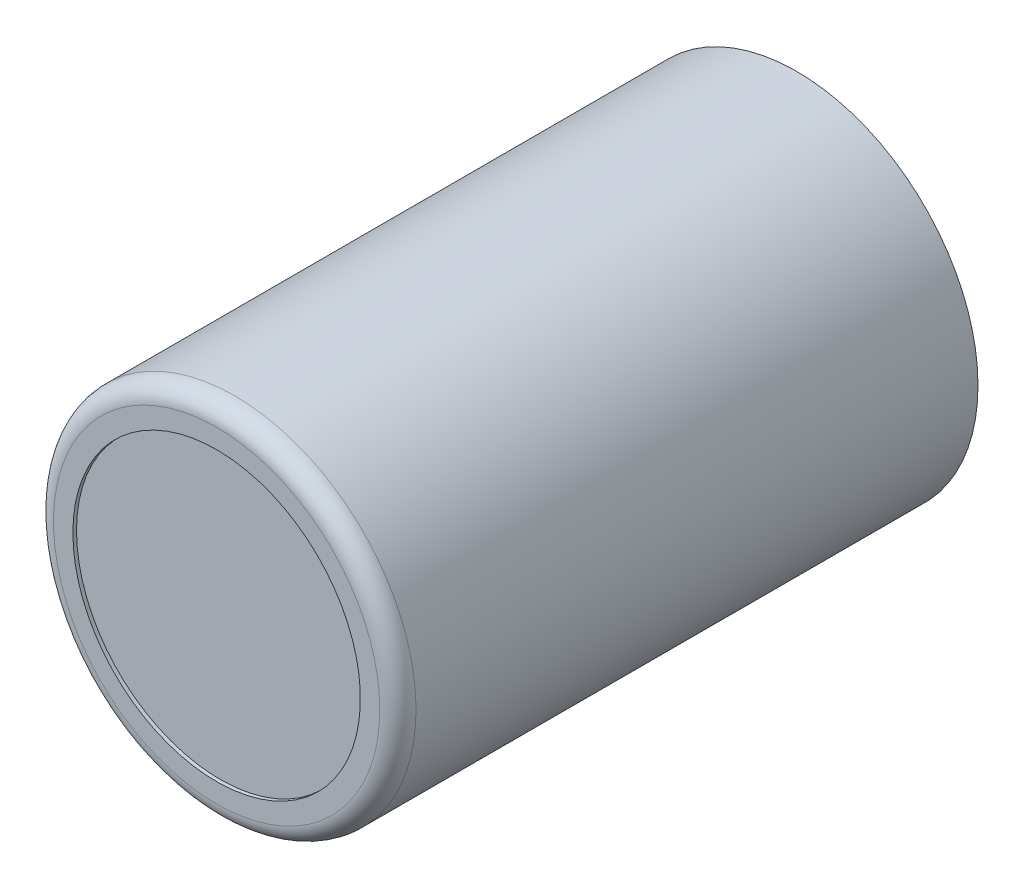
ISO-10303-21;
HEADER;
FILE_DESCRIPTION(('STEP AP214'),'2;1');
FILE_NAME('part.step','',(''),(''),'','','');
FILE_SCHEMA(('AUTOMOTIVE_DESIGN { 1 0 10303 214 1 1 1 1 }'));
ENDSEC;
DATA;
#1=APPLICATION_CONTEXT('core data for automotive mechanical design processes');
#2=APPLICATION_PROTOCOL_DEFINITION('international standard','automotive_design',2000,#1);
#3=PRODUCT_CONTEXT('',#1,'mechanical');
#4=PRODUCT('Part','Part','',(#3));
#5=PRODUCT_RELATED_PRODUCT_CATEGORY('part','',(#4));
#6=PRODUCT_DEFINITION_FORMATION('','',#4);
#7=PRODUCT_DEFINITION_CONTEXT('part definition',#1,'design');
#8=PRODUCT_DEFINITION('design','',#6,#7);
#9=PRODUCT_DEFINITION_SHAPE('','',#8);
#10=(LENGTH_UNIT() NAMED_UNIT(*) SI_UNIT(.MILLI.,.METRE.));
#11=(NAMED_UNIT(*) PLANE_ANGLE_UNIT() SI_UNIT($,.RADIAN.));
#12=(NAMED_UNIT(*) SI_UNIT($,.STERADIAN.) SOLID_ANGLE_UNIT());
#13=UNCERTAINTY_MEASURE_WITH_UNIT(LENGTH_MEASURE(1.E-05),#10,'distance_accuracy_value','');
#14=(GEOMETRIC_REPRESENTATION_CONTEXT(3) GLOBAL_UNCERTAINTY_ASSIGNED_CONTEXT((#13)) GLOBAL_UNIT_ASSIGNED_CONTEXT((#10,
#11,#12)) REPRESENTATION_CONTEXT('',''));
#15=CARTESIAN_POINT('',(0.,0.,0.));
#16=DIRECTION('',(0.,0.,1.));
#17=DIRECTION('',(1.,0.,0.));
#18=AXIS2_PLACEMENT_3D('',#15,#16,#17);
#19=CARTESIAN_POINT('',(6.985,-6.985,-10.16));
#20=DIRECTION('',(0.,0.,-1.));
#21=DIRECTION('',(-1.,0.,0.));
#22=AXIS2_PLACEMENT_3D('',#19,#20,#21);
#23=PLANE('',#22);
#24=CARTESIAN_POINT('',(0.,0.,-10.16));
#25=DIRECTION('',(0.,0.,1.));
#26=DIRECTION('',(1.,0.,0.));
#27=AXIS2_PLACEMENT_3D('',#24,#25,#26);
#28=CIRCLE('',#27,6.35);
#29=CARTESIAN_POINT('',(6.35,0.,-10.16));
#30=VERTEX_POINT('',#29);
#31=EDGE_CURVE('E21',#30,#30,#28,.T.);
#32=ORIENTED_EDGE('',*,*,#31,.F.);
#33=EDGE_LOOP('',(#32));
#34=FACE_BOUND('',#33,.T.);
#35=ADVANCED_FACE('F17',(#34),#23,.T.);
#36=CARTESIAN_POINT('',(0.,0.,9.525));
#37=DIRECTION('',(0.,0.,1.));
#38=DIRECTION('',(1.,0.,0.));
#39=AXIS2_PLACEMENT_3D('',#36,#37,#38);
#40=CYLINDRICAL_SURFACE('',#39,6.35);
#41=CARTESIAN_POINT('',(0.,0.,9.525));
#42=DIRECTION('',(0.,0.,1.));
#43=DIRECTION('',(-1.,0.,0.));
#44=AXIS2_PLACEMENT_3D('',#41,#42,#43);
#45=CIRCLE('',#44,6.35);
#46=CARTESIAN_POINT('',(-6.35,0.,9.525));
#47=VERTEX_POINT('',#46);
#48=EDGE_CURVE('E35',#47,#47,#45,.T.);
#49=ORIENTED_EDGE('',*,*,#48,.F.);
#50=EDGE_LOOP('',(#49));
#51=FACE_BOUND('',#50,.T.);
#52=ORIENTED_EDGE('',*,*,#31,.T.);
#53=EDGE_LOOP('',(#52));
#54=FACE_BOUND('',#53,.T.);
#55=ADVANCED_FACE('F54',(#51,#54),#40,.T.);
#56=CARTESIAN_POINT('',(0.,0.,9.525));
#57=DIRECTION('',(0.,0.,1.));
#58=DIRECTION('',(-1.,0.,0.));
#59=AXIS2_PLACEMENT_3D('',#56,#57,#58);
#60=TOROIDAL_SURFACE('',#59,5.715,0.635);
#61=ORIENTED_EDGE('',*,*,#48,.T.);
#62=EDGE_LOOP('',(#61));
#63=FACE_BOUND('',#62,.T.);
#64=CARTESIAN_POINT('',(0.,0.,10.16));
#65=DIRECTION('',(0.,0.,-1.));
#66=DIRECTION('',(1.,0.,0.));
#67=AXIS2_PLACEMENT_3D('',#64,#65,#66);
#68=CIRCLE('',#67,5.715);
#69=CARTESIAN_POINT('',(5.715,0.,10.16));
#70=VERTEX_POINT('',#69);
#71=EDGE_CURVE('E30',#70,#70,#68,.F.);
#72=ORIENTED_EDGE('',*,*,#71,.F.);
#73=EDGE_LOOP('',(#72));
#74=FACE_BOUND('',#73,.T.);
#75=ADVANCED_FACE('F32',(#63,#74),#60,.T.);
#76=CARTESIAN_POINT('',(-5.53895982894429,-5.53895982894429,10.033));
#77=DIRECTION('',(0.,0.,1.));
#78=DIRECTION('',(1.,0.,0.));
#79=AXIS2_PLACEMENT_3D('',#76,#77,#78);
#80=PLANE('',#79);
#81=CARTESIAN_POINT('',(0.,0.,10.033));
#82=DIRECTION('',(0.,0.,-1.));
#83=DIRECTION('',(-1.,0.,0.));
#84=AXIS2_PLACEMENT_3D('',#81,#82,#83);
#85=CIRCLE('',#84,5.035418026313);
#86=CARTESIAN_POINT('',(-5.035418026313,0.,10.033));
#87=VERTEX_POINT('',#86);
#88=EDGE_CURVE('E25',#87,#87,#85,.T.);
#89=ORIENTED_EDGE('',*,*,#88,.F.);
#90=EDGE_LOOP('',(#89));
#91=FACE_BOUND('',#90,.T.);
#92=ADVANCED_FACE('F53',(#91),#80,.T.);
#93=CARTESIAN_POINT('',(-6.2865,-6.2865,10.16));
#94=DIRECTION('',(0.,0.,1.));
#95=DIRECTION('',(1.,0.,0.));
#96=AXIS2_PLACEMENT_3D('',#93,#94,#95);
#97=PLANE('',#96);
#98=CARTESIAN_POINT('',(0.,0.,10.16));
#99=DIRECTION('',(0.,0.,-1.));
#100=DIRECTION('',(-1.,0.,0.));
#101=AXIS2_PLACEMENT_3D('',#98,#99,#100);
#102=CIRCLE('',#101,5.035418026313);
#103=CARTESIAN_POINT('',(-5.035418026313,0.,10.16));
#104=VERTEX_POINT('',#103);
#105=EDGE_CURVE('E11',#104,#104,#102,.F.);
#106=ORIENTED_EDGE('',*,*,#105,.F.);
#107=EDGE_LOOP('',(#106));
#108=FACE_BOUND('',#107,.T.);
#109=ORIENTED_EDGE('',*,*,#71,.T.);
#110=EDGE_LOOP('',(#109));
#111=FACE_BOUND('',#110,.T.);
#112=ADVANCED_FACE('F74',(#108,#111),#97,.T.);
#113=CARTESIAN_POINT('',(0.,0.,10.16));
#114=DIRECTION('',(0.,0.,-1.));
#115=DIRECTION('',(-1.,0.,0.));
#116=AXIS2_PLACEMENT_3D('',#113,#114,#115);
#117=CYLINDRICAL_SURFACE('',#116,5.035418026313);
#118=ORIENTED_EDGE('',*,*,#105,.T.);
#119=EDGE_LOOP('',(#118));
#120=FACE_BOUND('',#119,.T.);
#121=ORIENTED_EDGE('',*,*,#88,.T.);
#122=EDGE_LOOP('',(#121));
#123=FACE_BOUND('',#122,.T.);
#124=ADVANCED_FACE('F19',(#120,#123),#117,.F.);
#125=CLOSED_SHELL('',(#35,#55,#75,#92,#112,#124));
#126=MANIFOLD_SOLID_BREP('B1',#125);
#127=ADVANCED_BREP_SHAPE_REPRESENTATION('',(#18,#126),#14);
#128=SHAPE_DEFINITION_REPRESENTATION(#9,#127);
ENDSEC;
END-ISO-10303-21;
